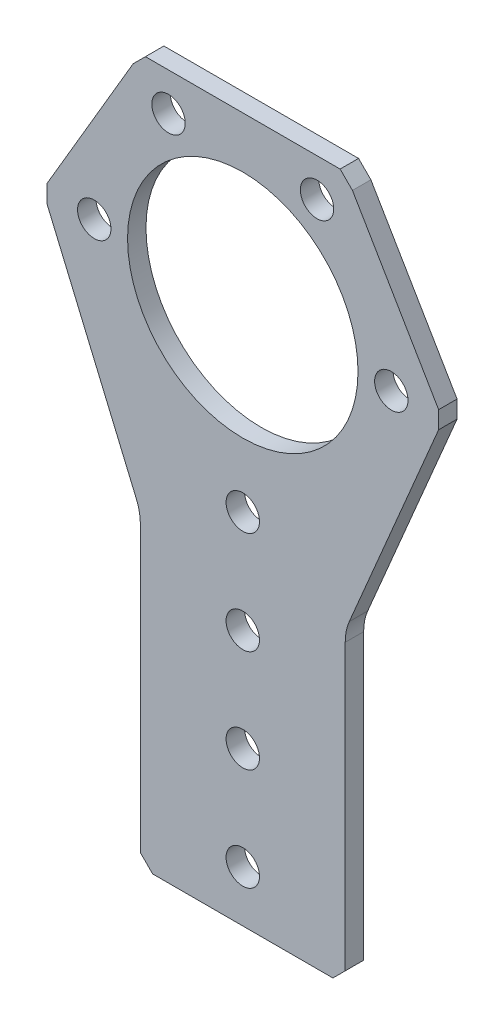
ISO-10303-21;
HEADER;
FILE_DESCRIPTION(('STEP AP214'),'2;1');
FILE_NAME('part.step','',(''),(''),'','','');
FILE_SCHEMA(('AUTOMOTIVE_DESIGN { 1 0 10303 214 1 1 1 1 }'));
ENDSEC;
DATA;
#1=APPLICATION_CONTEXT('core data for automotive mechanical design processes');
#2=APPLICATION_PROTOCOL_DEFINITION('international standard','automotive_design',2000,#1);
#3=PRODUCT_CONTEXT('',#1,'mechanical');
#4=PRODUCT('Part','Part','',(#3));
#5=PRODUCT_RELATED_PRODUCT_CATEGORY('part','',(#4));
#6=PRODUCT_DEFINITION_FORMATION('','',#4);
#7=PRODUCT_DEFINITION_CONTEXT('part definition',#1,'design');
#8=PRODUCT_DEFINITION('design','',#6,#7);
#9=PRODUCT_DEFINITION_SHAPE('','',#8);
#10=(LENGTH_UNIT() NAMED_UNIT(*) SI_UNIT(.MILLI.,.METRE.));
#11=(NAMED_UNIT(*) PLANE_ANGLE_UNIT() SI_UNIT($,.RADIAN.));
#12=(NAMED_UNIT(*) SI_UNIT($,.STERADIAN.) SOLID_ANGLE_UNIT());
#13=UNCERTAINTY_MEASURE_WITH_UNIT(LENGTH_MEASURE(1.E-05),#10,'distance_accuracy_value','');
#14=(GEOMETRIC_REPRESENTATION_CONTEXT(3) GLOBAL_UNCERTAINTY_ASSIGNED_CONTEXT((#13)) GLOBAL_UNIT_ASSIGNED_CONTEXT((#10,
#11,#12)) REPRESENTATION_CONTEXT('',''));
#15=CARTESIAN_POINT('',(0.,0.,0.));
#16=DIRECTION('',(0.,0.,1.));
#17=DIRECTION('',(1.,0.,0.));
#18=AXIS2_PLACEMENT_3D('',#15,#16,#17);
#19=CARTESIAN_POINT('',(12.7,20.6375,2.286));
#20=DIRECTION('',(0.,0.,1.));
#21=DIRECTION('',(1.,0.,0.));
#22=AXIS2_PLACEMENT_3D('',#19,#20,#21);
#23=PLANE('',#22);
#24=DIRECTION('',(-0.390299848982142,0.920687801529116,0.));
#25=VECTOR('',#24,1.);
#26=CARTESIAN_POINT('',(-12.7,-28.575,2.286));
#27=LINE('',#26,#25);
#28=CARTESIAN_POINT('',(-24.2821380930031,-1.25361290322579,2.286));
#29=VERTEX_POINT('',#28);
#30=CARTESIAN_POINT('',(-13.2036324602901,-27.3869691466639,2.286));
#31=VERTEX_POINT('',#30);
#32=EDGE_CURVE('E201',#29,#31,#27,.F.);
#33=ORIENTED_EDGE('',*,*,#32,.T.);
#34=CARTESIAN_POINT('',(-19.05,-29.8653731877005,2.286));
#35=DIRECTION('',(0.,0.,1.));
#36=DIRECTION('',(1.,0.,0.));
#37=AXIS2_PLACEMENT_3D('',#34,#35,#36);
#38=CIRCLE('',#37,6.35);
#39=CARTESIAN_POINT('',(-12.7,-29.8653731877005,2.286));
#40=VERTEX_POINT('',#39);
#41=EDGE_CURVE('E280',#31,#40,#38,.F.);
#42=ORIENTED_EDGE('',*,*,#41,.T.);
#43=DIRECTION('',(0.,1.,0.));
#44=VECTOR('',#43,1.);
#45=CARTESIAN_POINT('',(-12.7,-28.575,2.286));
#46=LINE('',#45,#44);
#47=CARTESIAN_POINT('',(-12.7,-65.1483564594183,2.286));
#48=VERTEX_POINT('',#47);
#49=EDGE_CURVE('E193',#40,#48,#46,.F.);
#50=ORIENTED_EDGE('',*,*,#49,.T.);
#51=DIRECTION('',(0.707106781186555,-0.70710678118654,0.));
#52=VECTOR('',#51,1.);
#53=CARTESIAN_POINT('',(-38.924178229709,-38.9241782297099,2.286));
#54=LINE('',#53,#52);
#55=CARTESIAN_POINT('',(-11.1733564594182,-66.675,2.286));
#56=VERTEX_POINT('',#55);
#57=EDGE_CURVE('E191',#56,#48,#54,.F.);
#58=ORIENTED_EDGE('',*,*,#57,.F.);
#59=DIRECTION('',(1.,0.,0.));
#60=VECTOR('',#59,1.);
#61=CARTESIAN_POINT('',(-12.7,-66.675,2.286));
#62=LINE('',#61,#60);
#63=CARTESIAN_POINT('',(11.1733564594183,-66.675,2.286));
#64=VERTEX_POINT('',#63);
#65=EDGE_CURVE('E185',#56,#64,#62,.T.);
#66=ORIENTED_EDGE('',*,*,#65,.T.);
#67=DIRECTION('',(0.70710678118654,0.707106781186555,0.));
#68=VECTOR('',#67,1.);
#69=CARTESIAN_POINT('',(38.9241782297093,-38.9241782297084,2.286));
#70=LINE('',#69,#68);
#71=CARTESIAN_POINT('',(12.7,-65.1483564594182,2.286));
#72=VERTEX_POINT('',#71);
#73=EDGE_CURVE('E171',#72,#64,#70,.F.);
#74=ORIENTED_EDGE('',*,*,#73,.F.);
#75=DIRECTION('',(0.,-1.,0.));
#76=VECTOR('',#75,1.);
#77=CARTESIAN_POINT('',(12.7,-28.575,2.286));
#78=LINE('',#77,#76);
#79=CARTESIAN_POINT('',(12.7,-29.8653731877005,2.286));
#80=VERTEX_POINT('',#79);
#81=EDGE_CURVE('E125',#72,#80,#78,.F.);
#82=ORIENTED_EDGE('',*,*,#81,.T.);
#83=CARTESIAN_POINT('',(19.05,-29.8653731877005,2.286));
#84=DIRECTION('',(0.,0.,1.));
#85=DIRECTION('',(1.,0.,0.));
#86=AXIS2_PLACEMENT_3D('',#83,#84,#85);
#87=CIRCLE('',#86,6.35);
#88=CARTESIAN_POINT('',(13.2036324602901,-27.3869691466639,2.286));
#89=VERTEX_POINT('',#88);
#90=EDGE_CURVE('E128',#80,#89,#87,.F.);
#91=ORIENTED_EDGE('',*,*,#90,.T.);
#92=DIRECTION('',(-0.390299848982142,-0.920687801529116,0.));
#93=VECTOR('',#92,1.);
#94=CARTESIAN_POINT('',(24.8135722295241,0.,2.286));
#95=LINE('',#94,#93);
#96=CARTESIAN_POINT('',(24.282138093003,-1.25361290322581,2.286));
#97=VERTEX_POINT('',#96);
#98=EDGE_CURVE('E132',#89,#97,#95,.F.);
#99=ORIENTED_EDGE('',*,*,#98,.T.);
#100=DIRECTION('',(0.,1.,0.));
#101=VECTOR('',#100,1.);
#102=CARTESIAN_POINT('',(24.2821380930031,0.,2.286));
#103=LINE('',#102,#101);
#104=CARTESIAN_POINT('',(24.2821380930031,0.905387096774183,2.286));
#105=VERTEX_POINT('',#104);
#106=EDGE_CURVE('E145',#105,#97,#103,.F.);
#107=ORIENTED_EDGE('',*,*,#106,.F.);
#108=DIRECTION('',(0.506208556856748,-0.862411095107785,0.));
#109=VECTOR('',#108,1.);
#110=CARTESIAN_POINT('',(12.7,20.6375,2.286));
#111=LINE('',#110,#109);
#112=CARTESIAN_POINT('',(13.5960923947946,19.1108564594183,2.286));
#113=VERTEX_POINT('',#112);
#114=EDGE_CURVE('E233',#105,#113,#111,.F.);
#115=ORIENTED_EDGE('',*,*,#114,.T.);
#116=DIRECTION('',(-0.707106781186557,0.707106781186538,0.));
#117=VECTOR('',#116,1.);
#118=CARTESIAN_POINT('',(16.3534744271062,16.3534744271067,2.286));
#119=LINE('',#118,#117);
#120=CARTESIAN_POINT('',(12.0694488542128,20.6375,2.286));
#121=VERTEX_POINT('',#120);
#122=EDGE_CURVE('E228',#121,#113,#119,.F.);
#123=ORIENTED_EDGE('',*,*,#122,.F.);
#124=DIRECTION('',(1.,0.,0.));
#125=VECTOR('',#124,1.);
#126=CARTESIAN_POINT('',(-12.7,20.6375,2.286));
#127=LINE('',#126,#125);
#128=CARTESIAN_POINT('',(-12.0694488542129,20.6375,2.286));
#129=VERTEX_POINT('',#128);
#130=EDGE_CURVE('E222',#121,#129,#127,.F.);
#131=ORIENTED_EDGE('',*,*,#130,.T.);
#132=DIRECTION('',(0.70710678118654,0.707106781186555,0.));
#133=VECTOR('',#132,1.);
#134=CARTESIAN_POINT('',(-16.3534744271066,16.3534744271062,2.286));
#135=LINE('',#134,#133);
#136=CARTESIAN_POINT('',(-13.5960923947946,19.1108564594182,2.286));
#137=VERTEX_POINT('',#136);
#138=EDGE_CURVE('E217',#129,#137,#135,.F.);
#139=ORIENTED_EDGE('',*,*,#138,.T.);
#140=DIRECTION('',(0.506208556856748,0.862411095107785,0.));
#141=VECTOR('',#140,1.);
#142=CARTESIAN_POINT('',(-24.8135722295241,0.,2.286));
#143=LINE('',#142,#141);
#144=CARTESIAN_POINT('',(-24.2821380930031,0.905387096774195,2.286));
#145=VERTEX_POINT('',#144);
#146=EDGE_CURVE('E209',#137,#145,#143,.F.);
#147=ORIENTED_EDGE('',*,*,#146,.T.);
#148=DIRECTION('',(0.,1.,0.));
#149=VECTOR('',#148,1.);
#150=CARTESIAN_POINT('',(-24.2821380930031,0.,2.286));
#151=LINE('',#150,#149);
#152=EDGE_CURVE('E207',#29,#145,#151,.T.);
#153=ORIENTED_EDGE('',*,*,#152,.F.);
#154=EDGE_LOOP('',(#33,#42,#50,#58,#66,#74,#82,#91,#99,#107,#115,#123,#131,#139,#147,#153));
#155=FACE_BOUND('',#154,.T.);
#156=CARTESIAN_POINT('',(-9.20749999999996,15.9478578106905,2.286));
#157=DIRECTION('',(0.,0.,-1.));
#158=DIRECTION('',(-1.,0.,0.));
#159=AXIS2_PLACEMENT_3D('',#156,#157,#158);
#160=CIRCLE('',#159,2.0701);
#161=CARTESIAN_POINT('',(-11.2776,15.9478578106905,2.286));
#162=VERTEX_POINT('',#161);
#163=EDGE_CURVE('E188',#162,#162,#160,.T.);
#164=ORIENTED_EDGE('',*,*,#163,.T.);
#165=EDGE_LOOP('',(#164));
#166=FACE_BOUND('',#165,.T.);
#167=CARTESIAN_POINT('',(-18.415,0.,2.286));
#168=DIRECTION('',(0.,0.,-1.));
#169=DIRECTION('',(-1.,0.,0.));
#170=AXIS2_PLACEMENT_3D('',#167,#168,#169);
#171=CIRCLE('',#170,2.0701);
#172=CARTESIAN_POINT('',(-20.4851,0.,2.286));
#173=VERTEX_POINT('',#172);
#174=EDGE_CURVE('E285',#173,#173,#171,.T.);
#175=ORIENTED_EDGE('',*,*,#174,.T.);
#176=EDGE_LOOP('',(#175));
#177=FACE_BOUND('',#176,.T.);
#178=CARTESIAN_POINT('',(2.66050878019847E-13,-47.625,2.286));
#179=DIRECTION('',(0.,0.,-1.));
#180=DIRECTION('',(-1.,0.,0.));
#181=AXIS2_PLACEMENT_3D('',#178,#179,#180);
#182=CIRCLE('',#181,2.0701);
#183=CARTESIAN_POINT('',(-2.07009999999973,-47.625,2.286));
#184=VERTEX_POINT('',#183);
#185=EDGE_CURVE('E288',#184,#184,#182,.T.);
#186=ORIENTED_EDGE('',*,*,#185,.T.);
#187=EDGE_LOOP('',(#186));
#188=FACE_BOUND('',#187,.T.);
#189=CARTESIAN_POINT('',(0.,-22.225,2.286));
#190=DIRECTION('',(0.,0.,-1.));
#191=DIRECTION('',(-1.,0.,0.));
#192=AXIS2_PLACEMENT_3D('',#189,#190,#191);
#193=CIRCLE('',#192,2.0701);
#194=CARTESIAN_POINT('',(-2.0701,-22.225,2.286));
#195=VERTEX_POINT('',#194);
#196=EDGE_CURVE('E291',#195,#195,#193,.T.);
#197=ORIENTED_EDGE('',*,*,#196,.T.);
#198=EDGE_LOOP('',(#197));
#199=FACE_BOUND('',#198,.T.);
#200=CARTESIAN_POINT('',(0.,0.,2.286));
#201=DIRECTION('',(0.,0.,-1.));
#202=DIRECTION('',(-1.,0.,0.));
#203=AXIS2_PLACEMENT_3D('',#200,#201,#202);
#204=CIRCLE('',#203,14.2875);
#205=CARTESIAN_POINT('',(-14.2875,0.,2.286));
#206=VERTEX_POINT('',#205);
#207=EDGE_CURVE('E294',#206,#206,#204,.T.);
#208=ORIENTED_EDGE('',*,*,#207,.T.);
#209=EDGE_LOOP('',(#208));
#210=FACE_BOUND('',#209,.T.);
#211=CARTESIAN_POINT('',(1.33025439009923E-13,-34.925,2.286));
#212=DIRECTION('',(0.,0.,-1.));
#213=DIRECTION('',(-1.,0.,0.));
#214=AXIS2_PLACEMENT_3D('',#211,#212,#213);
#215=CIRCLE('',#214,2.0701);
#216=CARTESIAN_POINT('',(-2.07009999999987,-34.925,2.286));
#217=VERTEX_POINT('',#216);
#218=EDGE_CURVE('E297',#217,#217,#215,.T.);
#219=ORIENTED_EDGE('',*,*,#218,.T.);
#220=EDGE_LOOP('',(#219));
#221=FACE_BOUND('',#220,.T.);
#222=CARTESIAN_POINT('',(3.9907631702977E-13,-60.325,2.286));
#223=DIRECTION('',(0.,0.,-1.));
#224=DIRECTION('',(-1.,0.,0.));
#225=AXIS2_PLACEMENT_3D('',#222,#223,#224);
#226=CIRCLE('',#225,2.0701);
#227=CARTESIAN_POINT('',(-2.0700999999996,-60.325,2.286));
#228=VERTEX_POINT('',#227);
#229=EDGE_CURVE('E300',#228,#228,#226,.T.);
#230=ORIENTED_EDGE('',*,*,#229,.T.);
#231=EDGE_LOOP('',(#230));
#232=FACE_BOUND('',#231,.T.);
#233=CARTESIAN_POINT('',(18.415,0.,2.286));
#234=DIRECTION('',(0.,0.,-1.));
#235=DIRECTION('',(-1.,0.,0.));
#236=AXIS2_PLACEMENT_3D('',#233,#234,#235);
#237=CIRCLE('',#236,2.0701);
#238=CARTESIAN_POINT('',(16.3449,0.,2.286));
#239=VERTEX_POINT('',#238);
#240=EDGE_CURVE('E302',#239,#239,#237,.T.);
#241=ORIENTED_EDGE('',*,*,#240,.T.);
#242=EDGE_LOOP('',(#241));
#243=FACE_BOUND('',#242,.T.);
#244=CARTESIAN_POINT('',(9.20750000000008,15.9478578106904,2.286));
#245=DIRECTION('',(0.,0.,-1.));
#246=DIRECTION('',(-1.,0.,0.));
#247=AXIS2_PLACEMENT_3D('',#244,#245,#246);
#248=CIRCLE('',#247,2.0701);
#249=CARTESIAN_POINT('',(7.13740000000008,15.9478578106904,2.286));
#250=VERTEX_POINT('',#249);
#251=EDGE_CURVE('E20',#250,#250,#248,.T.);
#252=ORIENTED_EDGE('',*,*,#251,.T.);
#253=EDGE_LOOP('',(#252));
#254=FACE_BOUND('',#253,.T.);
#255=ADVANCED_FACE('F17',(#155,#166,#177,#188,#199,#210,#221,#232,#243,#254),#23,.T.);
#256=CARTESIAN_POINT('',(9.20750000000008,15.9478578106904,2.286));
#257=DIRECTION('',(0.,0.,-1.));
#258=DIRECTION('',(-1.,0.,0.));
#259=AXIS2_PLACEMENT_3D('',#256,#257,#258);
#260=CYLINDRICAL_SURFACE('',#259,2.0701);
#261=CARTESIAN_POINT('',(9.20750000000008,15.9478578106904,0.));
#262=DIRECTION('',(0.,0.,-1.));
#263=DIRECTION('',(-1.,0.,0.));
#264=AXIS2_PLACEMENT_3D('',#261,#262,#263);
#265=CIRCLE('',#264,2.0701);
#266=CARTESIAN_POINT('',(7.13740000000008,15.9478578106904,0.));
#267=VERTEX_POINT('',#266);
#268=EDGE_CURVE('E182',#267,#267,#265,.T.);
#269=ORIENTED_EDGE('',*,*,#268,.T.);
#270=EDGE_LOOP('',(#269));
#271=FACE_BOUND('',#270,.T.);
#272=ORIENTED_EDGE('',*,*,#251,.F.);
#273=EDGE_LOOP('',(#272));
#274=FACE_BOUND('',#273,.T.);
#275=ADVANCED_FACE('F310',(#271,#274),#260,.F.);
#276=CARTESIAN_POINT('',(18.415,0.,2.286));
#277=DIRECTION('',(0.,0.,-1.));
#278=DIRECTION('',(-1.,0.,0.));
#279=AXIS2_PLACEMENT_3D('',#276,#277,#278);
#280=CYLINDRICAL_SURFACE('',#279,2.0701);
#281=CARTESIAN_POINT('',(18.415,0.,0.));
#282=DIRECTION('',(0.,0.,-1.));
#283=DIRECTION('',(-1.,0.,0.));
#284=AXIS2_PLACEMENT_3D('',#281,#282,#283);
#285=CIRCLE('',#284,2.0701);
#286=CARTESIAN_POINT('',(16.3449,0.,0.));
#287=VERTEX_POINT('',#286);
#288=EDGE_CURVE('E275',#287,#287,#285,.T.);
#289=ORIENTED_EDGE('',*,*,#288,.T.);
#290=EDGE_LOOP('',(#289));
#291=FACE_BOUND('',#290,.T.);
#292=ORIENTED_EDGE('',*,*,#240,.F.);
#293=EDGE_LOOP('',(#292));
#294=FACE_BOUND('',#293,.T.);
#295=ADVANCED_FACE('F312',(#291,#294),#280,.F.);
#296=CARTESIAN_POINT('',(3.9907631702977E-13,-60.325,2.286));
#297=DIRECTION('',(0.,0.,-1.));
#298=DIRECTION('',(-1.,0.,0.));
#299=AXIS2_PLACEMENT_3D('',#296,#297,#298);
#300=CYLINDRICAL_SURFACE('',#299,2.0701);
#301=CARTESIAN_POINT('',(3.9907631702977E-13,-60.325,0.));
#302=DIRECTION('',(0.,0.,-1.));
#303=DIRECTION('',(-1.,0.,0.));
#304=AXIS2_PLACEMENT_3D('',#301,#302,#303);
#305=CIRCLE('',#304,2.0701);
#306=CARTESIAN_POINT('',(-2.0700999999996,-60.325,0.));
#307=VERTEX_POINT('',#306);
#308=EDGE_CURVE('E272',#307,#307,#305,.T.);
#309=ORIENTED_EDGE('',*,*,#308,.T.);
#310=EDGE_LOOP('',(#309));
#311=FACE_BOUND('',#310,.T.);
#312=ORIENTED_EDGE('',*,*,#229,.F.);
#313=EDGE_LOOP('',(#312));
#314=FACE_BOUND('',#313,.T.);
#315=ADVANCED_FACE('F319',(#311,#314),#300,.F.);
#316=CARTESIAN_POINT('',(1.33025439009923E-13,-34.925,2.286));
#317=DIRECTION('',(0.,0.,-1.));
#318=DIRECTION('',(-1.,0.,0.));
#319=AXIS2_PLACEMENT_3D('',#316,#317,#318);
#320=CYLINDRICAL_SURFACE('',#319,2.0701);
#321=CARTESIAN_POINT('',(1.33025439009923E-13,-34.925,0.));
#322=DIRECTION('',(0.,0.,-1.));
#323=DIRECTION('',(-1.,0.,0.));
#324=AXIS2_PLACEMENT_3D('',#321,#322,#323);
#325=CIRCLE('',#324,2.0701);
#326=CARTESIAN_POINT('',(-2.07009999999987,-34.925,0.));
#327=VERTEX_POINT('',#326);
#328=EDGE_CURVE('E269',#327,#327,#325,.T.);
#329=ORIENTED_EDGE('',*,*,#328,.T.);
#330=EDGE_LOOP('',(#329));
#331=FACE_BOUND('',#330,.T.);
#332=ORIENTED_EDGE('',*,*,#218,.F.);
#333=EDGE_LOOP('',(#332));
#334=FACE_BOUND('',#333,.T.);
#335=ADVANCED_FACE('F409',(#331,#334),#320,.F.);
#336=CARTESIAN_POINT('',(0.,0.,2.286));
#337=DIRECTION('',(0.,0.,-1.));
#338=DIRECTION('',(-1.,0.,0.));
#339=AXIS2_PLACEMENT_3D('',#336,#337,#338);
#340=CYLINDRICAL_SURFACE('',#339,14.2875);
#341=CARTESIAN_POINT('',(0.,0.,0.));
#342=DIRECTION('',(0.,0.,-1.));
#343=DIRECTION('',(-1.,0.,0.));
#344=AXIS2_PLACEMENT_3D('',#341,#342,#343);
#345=CIRCLE('',#344,14.2875);
#346=CARTESIAN_POINT('',(-14.2875,0.,0.));
#347=VERTEX_POINT('',#346);
#348=EDGE_CURVE('E266',#347,#347,#345,.T.);
#349=ORIENTED_EDGE('',*,*,#348,.T.);
#350=EDGE_LOOP('',(#349));
#351=FACE_BOUND('',#350,.T.);
#352=ORIENTED_EDGE('',*,*,#207,.F.);
#353=EDGE_LOOP('',(#352));
#354=FACE_BOUND('',#353,.T.);
#355=ADVANCED_FACE('F405',(#351,#354),#340,.F.);
#356=CARTESIAN_POINT('',(0.,-22.225,2.286));
#357=DIRECTION('',(0.,0.,-1.));
#358=DIRECTION('',(-1.,0.,0.));
#359=AXIS2_PLACEMENT_3D('',#356,#357,#358);
#360=CYLINDRICAL_SURFACE('',#359,2.0701);
#361=CARTESIAN_POINT('',(0.,-22.225,0.));
#362=DIRECTION('',(0.,0.,-1.));
#363=DIRECTION('',(-1.,0.,0.));
#364=AXIS2_PLACEMENT_3D('',#361,#362,#363);
#365=CIRCLE('',#364,2.0701);
#366=CARTESIAN_POINT('',(-2.0701,-22.225,0.));
#367=VERTEX_POINT('',#366);
#368=EDGE_CURVE('E263',#367,#367,#365,.T.);
#369=ORIENTED_EDGE('',*,*,#368,.T.);
#370=EDGE_LOOP('',(#369));
#371=FACE_BOUND('',#370,.T.);
#372=ORIENTED_EDGE('',*,*,#196,.F.);
#373=EDGE_LOOP('',(#372));
#374=FACE_BOUND('',#373,.T.);
#375=ADVANCED_FACE('F401',(#371,#374),#360,.F.);
#376=CARTESIAN_POINT('',(2.66050878019847E-13,-47.625,2.286));
#377=DIRECTION('',(0.,0.,-1.));
#378=DIRECTION('',(-1.,0.,0.));
#379=AXIS2_PLACEMENT_3D('',#376,#377,#378);
#380=CYLINDRICAL_SURFACE('',#379,2.0701);
#381=CARTESIAN_POINT('',(2.66050878019847E-13,-47.625,0.));
#382=DIRECTION('',(0.,0.,-1.));
#383=DIRECTION('',(-1.,0.,0.));
#384=AXIS2_PLACEMENT_3D('',#381,#382,#383);
#385=CIRCLE('',#384,2.0701);
#386=CARTESIAN_POINT('',(-2.07009999999973,-47.625,0.));
#387=VERTEX_POINT('',#386);
#388=EDGE_CURVE('E260',#387,#387,#385,.T.);
#389=ORIENTED_EDGE('',*,*,#388,.T.);
#390=EDGE_LOOP('',(#389));
#391=FACE_BOUND('',#390,.T.);
#392=ORIENTED_EDGE('',*,*,#185,.F.);
#393=EDGE_LOOP('',(#392));
#394=FACE_BOUND('',#393,.T.);
#395=ADVANCED_FACE('F397',(#391,#394),#380,.F.);
#396=CARTESIAN_POINT('',(-18.415,0.,2.286));
#397=DIRECTION('',(0.,0.,-1.));
#398=DIRECTION('',(-1.,0.,0.));
#399=AXIS2_PLACEMENT_3D('',#396,#397,#398);
#400=CYLINDRICAL_SURFACE('',#399,2.0701);
#401=CARTESIAN_POINT('',(-18.415,0.,0.));
#402=DIRECTION('',(0.,0.,-1.));
#403=DIRECTION('',(-1.,0.,0.));
#404=AXIS2_PLACEMENT_3D('',#401,#402,#403);
#405=CIRCLE('',#404,2.0701);
#406=CARTESIAN_POINT('',(-20.4851,0.,0.));
#407=VERTEX_POINT('',#406);
#408=EDGE_CURVE('E257',#407,#407,#405,.T.);
#409=ORIENTED_EDGE('',*,*,#408,.T.);
#410=EDGE_LOOP('',(#409));
#411=FACE_BOUND('',#410,.T.);
#412=ORIENTED_EDGE('',*,*,#174,.F.);
#413=EDGE_LOOP('',(#412));
#414=FACE_BOUND('',#413,.T.);
#415=ADVANCED_FACE('F393',(#411,#414),#400,.F.);
#416=CARTESIAN_POINT('',(-9.20749999999996,15.9478578106905,2.286));
#417=DIRECTION('',(0.,0.,-1.));
#418=DIRECTION('',(-1.,0.,0.));
#419=AXIS2_PLACEMENT_3D('',#416,#417,#418);
#420=CYLINDRICAL_SURFACE('',#419,2.0701);
#421=CARTESIAN_POINT('',(-9.20749999999996,15.9478578106905,0.));
#422=DIRECTION('',(0.,0.,-1.));
#423=DIRECTION('',(-1.,0.,0.));
#424=AXIS2_PLACEMENT_3D('',#421,#422,#423);
#425=CIRCLE('',#424,2.0701);
#426=CARTESIAN_POINT('',(-11.2776,15.9478578106905,0.));
#427=VERTEX_POINT('',#426);
#428=EDGE_CURVE('E176',#427,#427,#425,.T.);
#429=ORIENTED_EDGE('',*,*,#428,.T.);
#430=EDGE_LOOP('',(#429));
#431=FACE_BOUND('',#430,.T.);
#432=ORIENTED_EDGE('',*,*,#163,.F.);
#433=EDGE_LOOP('',(#432));
#434=FACE_BOUND('',#433,.T.);
#435=ADVANCED_FACE('F389',(#431,#434),#420,.F.);
#436=CARTESIAN_POINT('',(-12.7,-66.675,2.286));
#437=DIRECTION('',(0.,1.,0.));
#438=DIRECTION('',(0.,0.,1.));
#439=AXIS2_PLACEMENT_3D('',#436,#437,#438);
#440=PLANE('',#439);
#441=DIRECTION('',(1.,0.,0.));
#442=VECTOR('',#441,1.);
#443=CARTESIAN_POINT('',(12.7,-66.675,0.));
#444=LINE('',#443,#442);
#445=CARTESIAN_POINT('',(-11.1733564594182,-66.675,0.));
#446=VERTEX_POINT('',#445);
#447=CARTESIAN_POINT('',(11.1733564594183,-66.675,0.));
#448=VERTEX_POINT('',#447);
#449=EDGE_CURVE('E166',#446,#448,#444,.T.);
#450=ORIENTED_EDGE('',*,*,#449,.T.);
#451=DIRECTION('',(0.,0.,1.));
#452=VECTOR('',#451,1.);
#453=CARTESIAN_POINT('',(11.1733564594183,-66.675,0.));
#454=LINE('',#453,#452);
#455=EDGE_CURVE('E169',#64,#448,#454,.F.);
#456=ORIENTED_EDGE('',*,*,#455,.F.);
#457=ORIENTED_EDGE('',*,*,#65,.F.);
#458=DIRECTION('',(0.,0.,1.));
#459=VECTOR('',#458,1.);
#460=CARTESIAN_POINT('',(-11.1733564594182,-66.675,0.));
#461=LINE('',#460,#459);
#462=EDGE_CURVE('E179',#446,#56,#461,.T.);
#463=ORIENTED_EDGE('',*,*,#462,.F.);
#464=EDGE_LOOP('',(#450,#456,#457,#463));
#465=FACE_BOUND('',#464,.T.);
#466=ADVANCED_FACE('F385',(#465),#440,.F.);
#467=CARTESIAN_POINT('',(38.9241782297093,-38.9241782297084,0.));
#468=DIRECTION('',(0.707106781186555,-0.70710678118654,0.));
#469=DIRECTION('',(0.70710678118654,0.707106781186555,0.));
#470=AXIS2_PLACEMENT_3D('',#467,#468,#469);
#471=PLANE('',#470);
#472=DIRECTION('',(0.70710678118654,0.707106781186556,0.));
#473=VECTOR('',#472,1.);
#474=CARTESIAN_POINT('',(11.1733564594183,-66.675,0.));
#475=LINE('',#474,#473);
#476=CARTESIAN_POINT('',(12.7,-65.1483564594182,0.));
#477=VERTEX_POINT('',#476);
#478=EDGE_CURVE('E162',#448,#477,#475,.T.);
#479=ORIENTED_EDGE('',*,*,#478,.T.);
#480=DIRECTION('',(0.,0.,1.));
#481=VECTOR('',#480,1.);
#482=CARTESIAN_POINT('',(12.7,-65.1483564594182,2.286));
#483=LINE('',#482,#481);
#484=EDGE_CURVE('E157',#477,#72,#483,.T.);
#485=ORIENTED_EDGE('',*,*,#484,.T.);
#486=ORIENTED_EDGE('',*,*,#73,.T.);
#487=ORIENTED_EDGE('',*,*,#455,.T.);
#488=EDGE_LOOP('',(#479,#485,#486,#487));
#489=FACE_BOUND('',#488,.T.);
#490=ADVANCED_FACE('F381',(#489),#471,.T.);
#491=CARTESIAN_POINT('',(12.7,-28.575,2.286));
#492=DIRECTION('',(-1.,0.,0.));
#493=DIRECTION('',(0.,-1.,0.));
#494=AXIS2_PLACEMENT_3D('',#491,#492,#493);
#495=PLANE('',#494);
#496=DIRECTION('',(0.,1.,0.));
#497=VECTOR('',#496,1.);
#498=CARTESIAN_POINT('',(12.7,20.6375,0.));
#499=LINE('',#498,#497);
#500=CARTESIAN_POINT('',(12.7,-29.8653731877005,0.));
#501=VERTEX_POINT('',#500);
#502=EDGE_CURVE('E165',#477,#501,#499,.T.);
#503=ORIENTED_EDGE('',*,*,#502,.T.);
#504=DIRECTION('',(0.,0.,1.));
#505=VECTOR('',#504,1.);
#506=CARTESIAN_POINT('',(12.7,-29.8653731877005,2.286));
#507=LINE('',#506,#505);
#508=EDGE_CURVE('E138',#501,#80,#507,.T.);
#509=ORIENTED_EDGE('',*,*,#508,.T.);
#510=ORIENTED_EDGE('',*,*,#81,.F.);
#511=ORIENTED_EDGE('',*,*,#484,.F.);
#512=EDGE_LOOP('',(#503,#509,#510,#511));
#513=FACE_BOUND('',#512,.T.);
#514=ADVANCED_FACE('F378',(#513),#495,.F.);
#515=CARTESIAN_POINT('',(19.05,-29.8653731877005,2.286));
#516=DIRECTION('',(0.,0.,1.));
#517=DIRECTION('',(1.,0.,0.));
#518=AXIS2_PLACEMENT_3D('',#515,#516,#517);
#519=CYLINDRICAL_SURFACE('',#518,6.35);
#520=ORIENTED_EDGE('',*,*,#508,.F.);
#521=CARTESIAN_POINT('',(19.05,-29.8653731877005,0.));
#522=DIRECTION('',(0.,0.,1.));
#523=DIRECTION('',(1.,0.,0.));
#524=AXIS2_PLACEMENT_3D('',#521,#522,#523);
#525=CIRCLE('',#524,6.35);
#526=CARTESIAN_POINT('',(13.2036324602901,-27.3869691466639,0.));
#527=VERTEX_POINT('',#526);
#528=EDGE_CURVE('E150',#501,#527,#525,.F.);
#529=ORIENTED_EDGE('',*,*,#528,.T.);
#530=DIRECTION('',(0.,0.,1.));
#531=VECTOR('',#530,1.);
#532=CARTESIAN_POINT('',(13.2036324602901,-27.3869691466639,2.286));
#533=LINE('',#532,#531);
#534=EDGE_CURVE('E137',#527,#89,#533,.T.);
#535=ORIENTED_EDGE('',*,*,#534,.T.);
#536=ORIENTED_EDGE('',*,*,#90,.F.);
#537=EDGE_LOOP('',(#520,#529,#535,#536));
#538=FACE_BOUND('',#537,.T.);
#539=ADVANCED_FACE('F148',(#538),#519,.F.);
#540=CARTESIAN_POINT('',(24.8135722295241,0.,2.286));
#541=DIRECTION('',(-0.920687801529116,0.390299848982142,0.));
#542=DIRECTION('',(-0.390299848982142,-0.920687801529116,0.));
#543=AXIS2_PLACEMENT_3D('',#540,#541,#542);
#544=PLANE('',#543);
#545=ORIENTED_EDGE('',*,*,#98,.F.);
#546=ORIENTED_EDGE('',*,*,#534,.F.);
#547=DIRECTION('',(0.390299848982142,0.920687801529116,0.));
#548=VECTOR('',#547,1.);
#549=CARTESIAN_POINT('',(13.2036324602901,-27.3869691466639,0.));
#550=LINE('',#549,#548);
#551=CARTESIAN_POINT('',(24.2821380930031,-1.25361290322579,0.));
#552=VERTEX_POINT('',#551);
#553=EDGE_CURVE('E254',#527,#552,#550,.T.);
#554=ORIENTED_EDGE('',*,*,#553,.T.);
#555=DIRECTION('',(0.,0.,-1.));
#556=VECTOR('',#555,1.);
#557=CARTESIAN_POINT('',(24.2821380930031,-1.25361290322581,0.));
#558=LINE('',#557,#556);
#559=EDGE_CURVE('E144',#97,#552,#558,.T.);
#560=ORIENTED_EDGE('',*,*,#559,.F.);
#561=EDGE_LOOP('',(#545,#546,#554,#560));
#562=FACE_BOUND('',#561,.T.);
#563=ADVANCED_FACE('F141',(#562),#544,.F.);
#564=CARTESIAN_POINT('',(24.2821380930031,0.,0.));
#565=DIRECTION('',(1.,0.,0.));
#566=DIRECTION('',(0.,0.,-1.));
#567=AXIS2_PLACEMENT_3D('',#564,#565,#566);
#568=PLANE('',#567);
#569=DIRECTION('',(0.,1.,0.));
#570=VECTOR('',#569,1.);
#571=CARTESIAN_POINT('',(24.2821380930031,20.6375,0.));
#572=LINE('',#571,#570);
#573=CARTESIAN_POINT('',(24.2821380930031,0.905387096774182,0.));
#574=VERTEX_POINT('',#573);
#575=EDGE_CURVE('E727',#552,#574,#572,.T.);
#576=ORIENTED_EDGE('',*,*,#575,.T.);
#577=DIRECTION('',(0.,0.,1.));
#578=VECTOR('',#577,1.);
#579=CARTESIAN_POINT('',(24.2821380930031,0.905387096774183,2.286));
#580=LINE('',#579,#578);
#581=EDGE_CURVE('E230',#574,#105,#580,.T.);
#582=ORIENTED_EDGE('',*,*,#581,.T.);
#583=ORIENTED_EDGE('',*,*,#106,.T.);
#584=ORIENTED_EDGE('',*,*,#559,.T.);
#585=EDGE_LOOP('',(#576,#582,#583,#584));
#586=FACE_BOUND('',#585,.T.);
#587=ADVANCED_FACE('F369',(#586),#568,.T.);
#588=CARTESIAN_POINT('',(12.7,20.6375,2.286));
#589=DIRECTION('',(-0.862411095107785,-0.506208556856748,0.));
#590=DIRECTION('',(0.506208556856748,-0.862411095107785,0.));
#591=AXIS2_PLACEMENT_3D('',#588,#589,#590);
#592=PLANE('',#591);
#593=DIRECTION('',(-0.506208556856748,0.862411095107785,0.));
#594=VECTOR('',#593,1.);
#595=CARTESIAN_POINT('',(24.2821380930031,0.90538709677418,0.));
#596=LINE('',#595,#594);
#597=CARTESIAN_POINT('',(13.5960923947946,19.1108564594183,0.));
#598=VERTEX_POINT('',#597);
#599=EDGE_CURVE('E719',#574,#598,#596,.T.);
#600=ORIENTED_EDGE('',*,*,#599,.T.);
#601=DIRECTION('',(0.,0.,1.));
#602=VECTOR('',#601,1.);
#603=CARTESIAN_POINT('',(13.5960923947946,19.1108564594183,0.));
#604=LINE('',#603,#602);
#605=EDGE_CURVE('E225',#113,#598,#604,.F.);
#606=ORIENTED_EDGE('',*,*,#605,.F.);
#607=ORIENTED_EDGE('',*,*,#114,.F.);
#608=ORIENTED_EDGE('',*,*,#581,.F.);
#609=EDGE_LOOP('',(#600,#606,#607,#608));
#610=FACE_BOUND('',#609,.T.);
#611=ADVANCED_FACE('F365',(#610),#592,.F.);
#612=CARTESIAN_POINT('',(16.3534744271062,16.3534744271067,0.));
#613=DIRECTION('',(0.707106781186538,0.707106781186557,0.));
#614=DIRECTION('',(-0.707106781186557,0.707106781186538,0.));
#615=AXIS2_PLACEMENT_3D('',#612,#613,#614);
#616=PLANE('',#615);
#617=DIRECTION('',(-0.707106781186556,0.707106781186539,0.));
#618=VECTOR('',#617,1.);
#619=CARTESIAN_POINT('',(13.5960923947946,19.1108564594183,0.));
#620=LINE('',#619,#618);
#621=CARTESIAN_POINT('',(12.0694488542128,20.6375,0.));
#622=VERTEX_POINT('',#621);
#623=EDGE_CURVE('E710',#598,#622,#620,.T.);
#624=ORIENTED_EDGE('',*,*,#623,.T.);
#625=DIRECTION('',(0.,0.,1.));
#626=VECTOR('',#625,1.);
#627=CARTESIAN_POINT('',(12.0694488542128,20.6375,2.286));
#628=LINE('',#627,#626);
#629=EDGE_CURVE('E224',#622,#121,#628,.T.);
#630=ORIENTED_EDGE('',*,*,#629,.T.);
#631=ORIENTED_EDGE('',*,*,#122,.T.);
#632=ORIENTED_EDGE('',*,*,#605,.T.);
#633=EDGE_LOOP('',(#624,#630,#631,#632));
#634=FACE_BOUND('',#633,.T.);
#635=ADVANCED_FACE('F361',(#634),#616,.T.);
#636=CARTESIAN_POINT('',(-12.7,20.6375,2.286));
#637=DIRECTION('',(0.,-1.,0.));
#638=DIRECTION('',(1.,0.,0.));
#639=AXIS2_PLACEMENT_3D('',#636,#637,#638);
#640=PLANE('',#639);
#641=DIRECTION('',(1.,0.,0.));
#642=VECTOR('',#641,1.);
#643=CARTESIAN_POINT('',(12.7,20.6375,0.));
#644=LINE('',#643,#642);
#645=CARTESIAN_POINT('',(-12.0694488542129,20.6375,0.));
#646=VERTEX_POINT('',#645);
#647=EDGE_CURVE('E701',#622,#646,#644,.F.);
#648=ORIENTED_EDGE('',*,*,#647,.T.);
#649=DIRECTION('',(0.,0.,1.));
#650=VECTOR('',#649,1.);
#651=CARTESIAN_POINT('',(-12.0694488542129,20.6375,0.));
#652=LINE('',#651,#650);
#653=EDGE_CURVE('E219',#646,#129,#652,.T.);
#654=ORIENTED_EDGE('',*,*,#653,.T.);
#655=ORIENTED_EDGE('',*,*,#130,.F.);
#656=ORIENTED_EDGE('',*,*,#629,.F.);
#657=EDGE_LOOP('',(#648,#654,#655,#656));
#658=FACE_BOUND('',#657,.T.);
#659=ADVANCED_FACE('F357',(#658),#640,.F.);
#660=CARTESIAN_POINT('',(-16.3534744271066,16.3534744271062,0.));
#661=DIRECTION('',(0.707106781186555,-0.70710678118654,0.));
#662=DIRECTION('',(0.70710678118654,0.707106781186555,0.));
#663=AXIS2_PLACEMENT_3D('',#660,#661,#662);
#664=PLANE('',#663);
#665=ORIENTED_EDGE('',*,*,#653,.F.);
#666=DIRECTION('',(-0.707106781186543,-0.707106781186552,0.));
#667=VECTOR('',#666,1.);
#668=CARTESIAN_POINT('',(-12.0694488542129,20.6375,0.));
#669=LINE('',#668,#667);
#670=CARTESIAN_POINT('',(-13.5960923947946,19.1108564594182,0.));
#671=VERTEX_POINT('',#670);
#672=EDGE_CURVE('E692',#646,#671,#669,.T.);
#673=ORIENTED_EDGE('',*,*,#672,.T.);
#674=DIRECTION('',(0.,0.,1.));
#675=VECTOR('',#674,1.);
#676=CARTESIAN_POINT('',(-13.5960923947946,19.1108564594182,2.286));
#677=LINE('',#676,#675);
#678=EDGE_CURVE('E214',#671,#137,#677,.T.);
#679=ORIENTED_EDGE('',*,*,#678,.T.);
#680=ORIENTED_EDGE('',*,*,#138,.F.);
#681=EDGE_LOOP('',(#665,#673,#679,#680));
#682=FACE_BOUND('',#681,.T.);
#683=ADVANCED_FACE('F353',(#682),#664,.F.);
#684=CARTESIAN_POINT('',(-24.8135722295241,0.,2.286));
#685=DIRECTION('',(0.862411095107785,-0.506208556856748,0.));
#686=DIRECTION('',(0.506208556856748,0.862411095107785,0.));
#687=AXIS2_PLACEMENT_3D('',#684,#685,#686);
#688=PLANE('',#687);
#689=ORIENTED_EDGE('',*,*,#146,.F.);
#690=ORIENTED_EDGE('',*,*,#678,.F.);
#691=DIRECTION('',(-0.506208556856748,-0.862411095107785,0.));
#692=VECTOR('',#691,1.);
#693=CARTESIAN_POINT('',(-13.5960923947946,19.1108564594182,0.));
#694=LINE('',#693,#692);
#695=CARTESIAN_POINT('',(-24.2821380930031,0.905387096774195,0.));
#696=VERTEX_POINT('',#695);
#697=EDGE_CURVE('E684',#671,#696,#694,.T.);
#698=ORIENTED_EDGE('',*,*,#697,.T.);
#699=DIRECTION('',(0.,0.,1.));
#700=VECTOR('',#699,1.);
#701=CARTESIAN_POINT('',(-24.2821380930031,0.905387096774195,0.));
#702=LINE('',#701,#700);
#703=EDGE_CURVE('E204',#145,#696,#702,.F.);
#704=ORIENTED_EDGE('',*,*,#703,.F.);
#705=EDGE_LOOP('',(#689,#690,#698,#704));
#706=FACE_BOUND('',#705,.T.);
#707=ADVANCED_FACE('F349',(#706),#688,.F.);
#708=CARTESIAN_POINT('',(-24.2821380930031,0.,0.));
#709=DIRECTION('',(-1.,0.,0.));
#710=DIRECTION('',(0.,0.,1.));
#711=AXIS2_PLACEMENT_3D('',#708,#709,#710);
#712=PLANE('',#711);
#713=DIRECTION('',(0.,1.,0.));
#714=VECTOR('',#713,1.);
#715=CARTESIAN_POINT('',(-24.2821380930031,20.6375,0.));
#716=LINE('',#715,#714);
#717=CARTESIAN_POINT('',(-24.2821380930031,-1.25361290322577,0.));
#718=VERTEX_POINT('',#717);
#719=EDGE_CURVE('E681',#696,#718,#716,.F.);
#720=ORIENTED_EDGE('',*,*,#719,.T.);
#721=DIRECTION('',(0.,0.,1.));
#722=VECTOR('',#721,1.);
#723=CARTESIAN_POINT('',(-24.2821380930031,-1.25361290322579,2.286));
#724=LINE('',#723,#722);
#725=EDGE_CURVE('E203',#718,#29,#724,.T.);
#726=ORIENTED_EDGE('',*,*,#725,.T.);
#727=ORIENTED_EDGE('',*,*,#152,.T.);
#728=ORIENTED_EDGE('',*,*,#703,.T.);
#729=EDGE_LOOP('',(#720,#726,#727,#728));
#730=FACE_BOUND('',#729,.T.);
#731=ADVANCED_FACE('F345',(#730),#712,.T.);
#732=CARTESIAN_POINT('',(-12.7,-28.575,2.286));
#733=DIRECTION('',(0.920687801529116,0.390299848982142,0.));
#734=DIRECTION('',(-0.390299848982142,0.920687801529116,0.));
#735=AXIS2_PLACEMENT_3D('',#732,#733,#734);
#736=PLANE('',#735);
#737=DIRECTION('',(0.390299848982142,-0.920687801529116,0.));
#738=VECTOR('',#737,1.);
#739=CARTESIAN_POINT('',(-24.2821380930031,-1.25361290322579,0.));
#740=LINE('',#739,#738);
#741=CARTESIAN_POINT('',(-13.2036324602901,-27.3869691466639,0.));
#742=VERTEX_POINT('',#741);
#743=EDGE_CURVE('E252',#718,#742,#740,.T.);
#744=ORIENTED_EDGE('',*,*,#743,.T.);
#745=DIRECTION('',(0.,0.,1.));
#746=VECTOR('',#745,1.);
#747=CARTESIAN_POINT('',(-13.2036324602901,-27.3869691466639,2.286));
#748=LINE('',#747,#746);
#749=EDGE_CURVE('E281',#742,#31,#748,.T.);
#750=ORIENTED_EDGE('',*,*,#749,.T.);
#751=ORIENTED_EDGE('',*,*,#32,.F.);
#752=ORIENTED_EDGE('',*,*,#725,.F.);
#753=EDGE_LOOP('',(#744,#750,#751,#752));
#754=FACE_BOUND('',#753,.T.);
#755=ADVANCED_FACE('F341',(#754),#736,.F.);
#756=CARTESIAN_POINT('',(-19.05,-29.8653731877005,2.286));
#757=DIRECTION('',(0.,0.,1.));
#758=DIRECTION('',(1.,0.,0.));
#759=AXIS2_PLACEMENT_3D('',#756,#757,#758);
#760=CYLINDRICAL_SURFACE('',#759,6.35);
#761=ORIENTED_EDGE('',*,*,#749,.F.);
#762=CARTESIAN_POINT('',(-19.05,-29.8653731877005,0.));
#763=DIRECTION('',(0.,0.,1.));
#764=DIRECTION('',(1.,0.,0.));
#765=AXIS2_PLACEMENT_3D('',#762,#763,#764);
#766=CIRCLE('',#765,6.35);
#767=CARTESIAN_POINT('',(-12.7,-29.8653731877005,0.));
#768=VERTEX_POINT('',#767);
#769=EDGE_CURVE('E249',#742,#768,#766,.F.);
#770=ORIENTED_EDGE('',*,*,#769,.T.);
#771=DIRECTION('',(0.,0.,1.));
#772=VECTOR('',#771,1.);
#773=CARTESIAN_POINT('',(-12.7,-29.8653731877005,2.286));
#774=LINE('',#773,#772);
#775=EDGE_CURVE('E198',#768,#40,#774,.T.);
#776=ORIENTED_EDGE('',*,*,#775,.T.);
#777=ORIENTED_EDGE('',*,*,#41,.F.);
#778=EDGE_LOOP('',(#761,#770,#776,#777));
#779=FACE_BOUND('',#778,.T.);
#780=ADVANCED_FACE('F337',(#779),#760,.F.);
#781=CARTESIAN_POINT('',(-12.7,-28.575,2.286));
#782=DIRECTION('',(1.,0.,0.));
#783=DIRECTION('',(0.,1.,0.));
#784=AXIS2_PLACEMENT_3D('',#781,#782,#783);
#785=PLANE('',#784);
#786=ORIENTED_EDGE('',*,*,#49,.F.);
#787=ORIENTED_EDGE('',*,*,#775,.F.);
#788=DIRECTION('',(0.,1.,0.));
#789=VECTOR('',#788,1.);
#790=CARTESIAN_POINT('',(-12.7,20.6375,0.));
#791=LINE('',#790,#789);
#792=CARTESIAN_POINT('',(-12.7,-65.1483564594183,0.));
#793=VERTEX_POINT('',#792);
#794=EDGE_CURVE('E26',#768,#793,#791,.F.);
#795=ORIENTED_EDGE('',*,*,#794,.T.);
#796=DIRECTION('',(0.,0.,1.));
#797=VECTOR('',#796,1.);
#798=CARTESIAN_POINT('',(-12.7,-65.1483564594183,0.));
#799=LINE('',#798,#797);
#800=EDGE_CURVE('E34',#48,#793,#799,.F.);
#801=ORIENTED_EDGE('',*,*,#800,.F.);
#802=EDGE_LOOP('',(#786,#787,#795,#801));
#803=FACE_BOUND('',#802,.T.);
#804=ADVANCED_FACE('F330',(#803),#785,.F.);
#805=CARTESIAN_POINT('',(-38.924178229709,-38.9241782297099,0.));
#806=DIRECTION('',(-0.70710678118654,-0.707106781186555,0.));
#807=DIRECTION('',(0.707106781186555,-0.70710678118654,0.));
#808=AXIS2_PLACEMENT_3D('',#805,#806,#807);
#809=PLANE('',#808);
#810=DIRECTION('',(0.707106781186555,-0.70710678118654,0.));
#811=VECTOR('',#810,1.);
#812=CARTESIAN_POINT('',(-12.7,-65.1483564594183,0.));
#813=LINE('',#812,#811);
#814=EDGE_CURVE('E11',#793,#446,#813,.T.);
#815=ORIENTED_EDGE('',*,*,#814,.T.);
#816=ORIENTED_EDGE('',*,*,#462,.T.);
#817=ORIENTED_EDGE('',*,*,#57,.T.);
#818=ORIENTED_EDGE('',*,*,#800,.T.);
#819=EDGE_LOOP('',(#815,#816,#817,#818));
#820=FACE_BOUND('',#819,.T.);
#821=ADVANCED_FACE('F324',(#820),#809,.T.);
#822=CARTESIAN_POINT('',(12.7,20.6375,0.));
#823=DIRECTION('',(0.,0.,1.));
#824=DIRECTION('',(1.,0.,0.));
#825=AXIS2_PLACEMENT_3D('',#822,#823,#824);
#826=PLANE('',#825);
#827=ORIENTED_EDGE('',*,*,#794,.F.);
#828=ORIENTED_EDGE('',*,*,#769,.F.);
#829=ORIENTED_EDGE('',*,*,#743,.F.);
#830=ORIENTED_EDGE('',*,*,#719,.F.);
#831=ORIENTED_EDGE('',*,*,#697,.F.);
#832=ORIENTED_EDGE('',*,*,#672,.F.);
#833=ORIENTED_EDGE('',*,*,#647,.F.);
#834=ORIENTED_EDGE('',*,*,#623,.F.);
#835=ORIENTED_EDGE('',*,*,#599,.F.);
#836=ORIENTED_EDGE('',*,*,#575,.F.);
#837=ORIENTED_EDGE('',*,*,#553,.F.);
#838=ORIENTED_EDGE('',*,*,#528,.F.);
#839=ORIENTED_EDGE('',*,*,#502,.F.);
#840=ORIENTED_EDGE('',*,*,#478,.F.);
#841=ORIENTED_EDGE('',*,*,#449,.F.);
#842=ORIENTED_EDGE('',*,*,#814,.F.);
#843=EDGE_LOOP('',(#827,#828,#829,#830,#831,#832,#833,#834,#835,#836,#837,#838,#839,#840,#841,#842));
#844=FACE_BOUND('',#843,.T.);
#845=ORIENTED_EDGE('',*,*,#428,.F.);
#846=EDGE_LOOP('',(#845));
#847=FACE_BOUND('',#846,.T.);
#848=ORIENTED_EDGE('',*,*,#408,.F.);
#849=EDGE_LOOP('',(#848));
#850=FACE_BOUND('',#849,.T.);
#851=ORIENTED_EDGE('',*,*,#388,.F.);
#852=EDGE_LOOP('',(#851));
#853=FACE_BOUND('',#852,.T.);
#854=ORIENTED_EDGE('',*,*,#368,.F.);
#855=EDGE_LOOP('',(#854));
#856=FACE_BOUND('',#855,.T.);
#857=ORIENTED_EDGE('',*,*,#348,.F.);
#858=EDGE_LOOP('',(#857));
#859=FACE_BOUND('',#858,.T.);
#860=ORIENTED_EDGE('',*,*,#328,.F.);
#861=EDGE_LOOP('',(#860));
#862=FACE_BOUND('',#861,.T.);
#863=ORIENTED_EDGE('',*,*,#308,.F.);
#864=EDGE_LOOP('',(#863));
#865=FACE_BOUND('',#864,.T.);
#866=ORIENTED_EDGE('',*,*,#288,.F.);
#867=EDGE_LOOP('',(#866));
#868=FACE_BOUND('',#867,.T.);
#869=ORIENTED_EDGE('',*,*,#268,.F.);
#870=EDGE_LOOP('',(#869));
#871=FACE_BOUND('',#870,.T.);
#872=ADVANCED_FACE('F322',(#844,#847,#850,#853,#856,#859,#862,#865,#868,#871),#826,.F.);
#873=CLOSED_SHELL('',(#255,#275,#295,#315,#335,#355,#375,#395,#415,#435,#466,#490,#514,#539,
#563,#587,#611,#635,#659,#683,#707,#731,#755,#780,#804,#821,#872));
#874=MANIFOLD_SOLID_BREP('B1',#873);
#875=ADVANCED_BREP_SHAPE_REPRESENTATION('',(#18,#874),#14);
#876=SHAPE_DEFINITION_REPRESENTATION(#9,#875);
ENDSEC;
END-ISO-10303-21;
